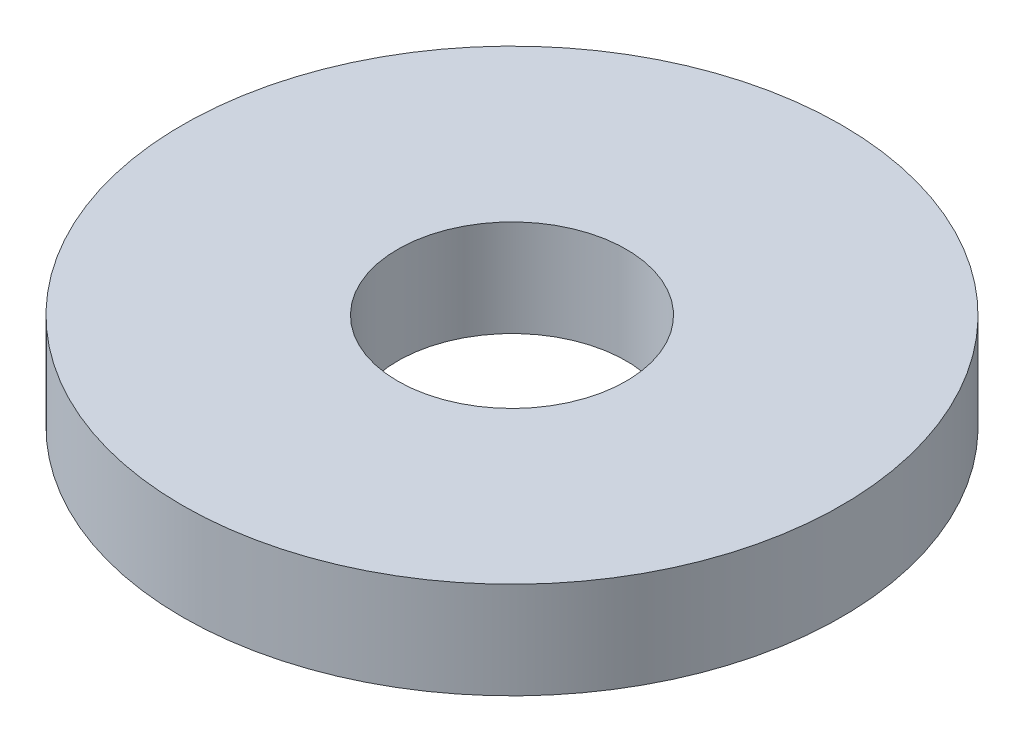
ISO-10303-21;
HEADER;
FILE_DESCRIPTION(('STEP AP214'),'2;1');
FILE_NAME('part.step','',(''),(''),'','','');
FILE_SCHEMA(('AUTOMOTIVE_DESIGN { 1 0 10303 214 1 1 1 1 }'));
ENDSEC;
DATA;
#1=APPLICATION_CONTEXT('core data for automotive mechanical design processes');
#2=APPLICATION_PROTOCOL_DEFINITION('international standard','automotive_design',2000,#1);
#3=PRODUCT_CONTEXT('',#1,'mechanical');
#4=PRODUCT('Part','Part','',(#3));
#5=PRODUCT_RELATED_PRODUCT_CATEGORY('part','',(#4));
#6=PRODUCT_DEFINITION_FORMATION('','',#4);
#7=PRODUCT_DEFINITION_CONTEXT('part definition',#1,'design');
#8=PRODUCT_DEFINITION('design','',#6,#7);
#9=PRODUCT_DEFINITION_SHAPE('','',#8);
#10=(LENGTH_UNIT() NAMED_UNIT(*) SI_UNIT(.MILLI.,.METRE.));
#11=(NAMED_UNIT(*) PLANE_ANGLE_UNIT() SI_UNIT($,.RADIAN.));
#12=(NAMED_UNIT(*) SI_UNIT($,.STERADIAN.) SOLID_ANGLE_UNIT());
#13=UNCERTAINTY_MEASURE_WITH_UNIT(LENGTH_MEASURE(1.E-05),#10,'distance_accuracy_value','');
#14=(GEOMETRIC_REPRESENTATION_CONTEXT(3) GLOBAL_UNCERTAINTY_ASSIGNED_CONTEXT((#13)) GLOBAL_UNIT_ASSIGNED_CONTEXT((#10,
#11,#12)) REPRESENTATION_CONTEXT('',''));
#15=CARTESIAN_POINT('',(0.,0.,0.));
#16=DIRECTION('',(0.,0.,1.));
#17=DIRECTION('',(1.,0.,0.));
#18=AXIS2_PLACEMENT_3D('',#15,#16,#17);
#19=CARTESIAN_POINT('',(0.,1.1,0.));
#20=DIRECTION('',(0.,-1.,0.));
#21=DIRECTION('',(0.,0.,-1.));
#22=AXIS2_PLACEMENT_3D('',#19,#20,#21);
#23=CYLINDRICAL_SURFACE('',#22,3.75);
#24=CARTESIAN_POINT('',(0.,1.1,0.));
#25=DIRECTION('',(0.,1.,0.));
#26=DIRECTION('',(0.,0.,1.));
#27=AXIS2_PLACEMENT_3D('',#24,#25,#26);
#28=CIRCLE('',#27,3.75);
#29=CARTESIAN_POINT('',(0.,1.1,3.75));
#30=VERTEX_POINT('',#29);
#31=EDGE_CURVE('E10',#30,#30,#28,.T.);
#32=ORIENTED_EDGE('',*,*,#31,.F.);
#33=EDGE_LOOP('',(#32));
#34=FACE_BOUND('',#33,.T.);
#35=CARTESIAN_POINT('',(0.,0.,0.));
#36=DIRECTION('',(0.,1.,0.));
#37=DIRECTION('',(0.,0.,1.));
#38=AXIS2_PLACEMENT_3D('',#35,#36,#37);
#39=CIRCLE('',#38,3.75);
#40=CARTESIAN_POINT('',(0.,0.,3.75));
#41=VERTEX_POINT('',#40);
#42=EDGE_CURVE('E33',#41,#41,#39,.T.);
#43=ORIENTED_EDGE('',*,*,#42,.T.);
#44=EDGE_LOOP('',(#43));
#45=FACE_BOUND('',#44,.T.);
#46=ADVANCED_FACE('F30',(#34,#45),#23,.T.);
#47=CARTESIAN_POINT('',(0.,1.1,0.));
#48=DIRECTION('',(0.,1.,0.));
#49=DIRECTION('',(0.,0.,1.));
#50=AXIS2_PLACEMENT_3D('',#47,#48,#49);
#51=PLANE('',#50);
#52=CARTESIAN_POINT('',(0.,1.1,0.));
#53=DIRECTION('',(0.,1.,0.));
#54=DIRECTION('',(0.,0.,1.));
#55=AXIS2_PLACEMENT_3D('',#52,#53,#54);
#56=CIRCLE('',#55,1.3);
#57=CARTESIAN_POINT('',(0.,1.1,1.3));
#58=VERTEX_POINT('',#57);
#59=EDGE_CURVE('E42',#58,#58,#56,.T.);
#60=ORIENTED_EDGE('',*,*,#59,.F.);
#61=EDGE_LOOP('',(#60));
#62=FACE_BOUND('',#61,.T.);
#63=ORIENTED_EDGE('',*,*,#31,.T.);
#64=EDGE_LOOP('',(#63));
#65=FACE_BOUND('',#64,.T.);
#66=ADVANCED_FACE('F57',(#62,#65),#51,.T.);
#67=CARTESIAN_POINT('',(0.,0.,0.));
#68=DIRECTION('',(0.,1.,0.));
#69=DIRECTION('',(0.,0.,1.));
#70=AXIS2_PLACEMENT_3D('',#67,#68,#69);
#71=PLANE('',#70);
#72=CARTESIAN_POINT('',(0.,0.,0.));
#73=DIRECTION('',(0.,1.,0.));
#74=DIRECTION('',(0.,0.,1.));
#75=AXIS2_PLACEMENT_3D('',#72,#73,#74);
#76=CIRCLE('',#75,1.3);
#77=CARTESIAN_POINT('',(0.,0.,1.3));
#78=VERTEX_POINT('',#77);
#79=EDGE_CURVE('E40',#78,#78,#76,.T.);
#80=ORIENTED_EDGE('',*,*,#79,.T.);
#81=EDGE_LOOP('',(#80));
#82=FACE_BOUND('',#81,.T.);
#83=ORIENTED_EDGE('',*,*,#42,.F.);
#84=EDGE_LOOP('',(#83));
#85=FACE_BOUND('',#84,.T.);
#86=ADVANCED_FACE('F48',(#82,#85),#71,.F.);
#87=CARTESIAN_POINT('',(0.,0.,0.));
#88=DIRECTION('',(0.,1.,0.));
#89=DIRECTION('',(0.,0.,1.));
#90=AXIS2_PLACEMENT_3D('',#87,#88,#89);
#91=CYLINDRICAL_SURFACE('',#90,1.3);
#92=ORIENTED_EDGE('',*,*,#79,.F.);
#93=EDGE_LOOP('',(#92));
#94=FACE_BOUND('',#93,.T.);
#95=ORIENTED_EDGE('',*,*,#59,.T.);
#96=EDGE_LOOP('',(#95));
#97=FACE_BOUND('',#96,.T.);
#98=ADVANCED_FACE('F51',(#94,#97),#91,.F.);
#99=CLOSED_SHELL('',(#46,#66,#86,#98));
#100=MANIFOLD_SOLID_BREP('B2',#99);
#101=ADVANCED_BREP_SHAPE_REPRESENTATION('',(#18,#100),#14);
#102=SHAPE_DEFINITION_REPRESENTATION(#9,#101);
ENDSEC;
END-ISO-10303-21;
